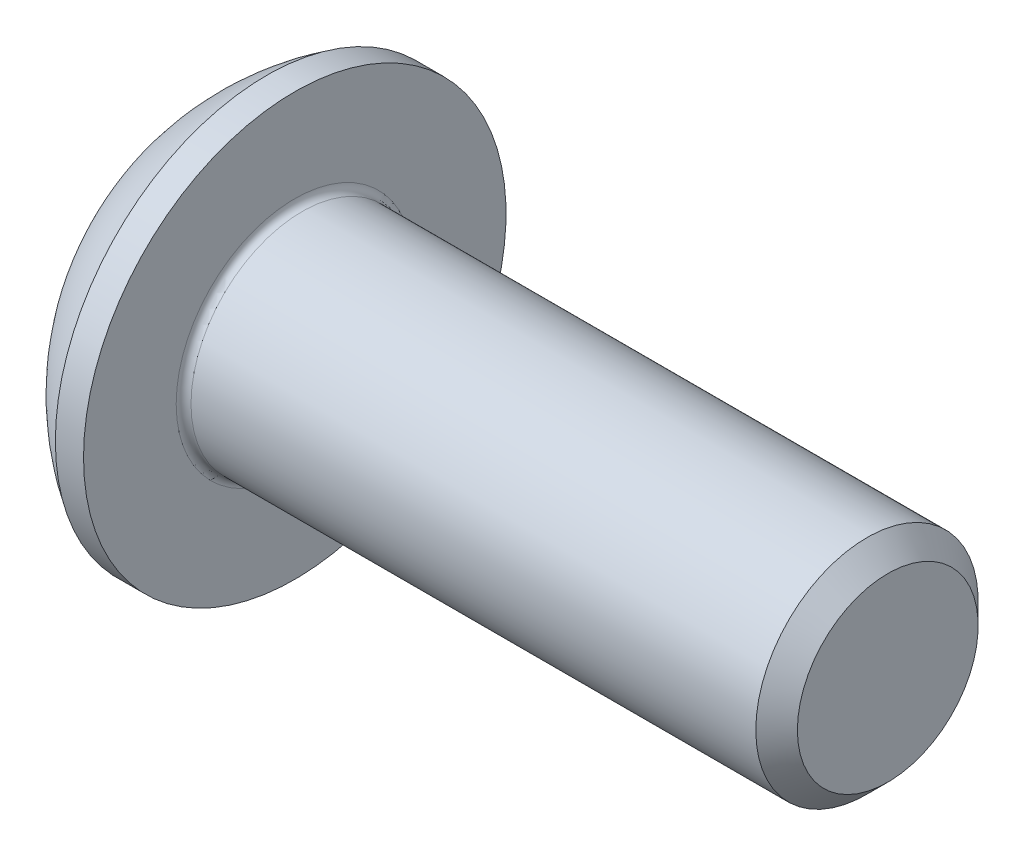
ISO-10303-21;
HEADER;
FILE_DESCRIPTION(('STEP AP214'),'2;1');
FILE_NAME('part.step','',(''),(''),'','','');
FILE_SCHEMA(('AUTOMOTIVE_DESIGN { 1 0 10303 214 1 1 1 1 }'));
ENDSEC;
DATA;
#1=APPLICATION_CONTEXT('core data for automotive mechanical design processes');
#2=APPLICATION_PROTOCOL_DEFINITION('international standard','automotive_design',2000,#1);
#3=PRODUCT_CONTEXT('',#1,'mechanical');
#4=PRODUCT('Part','Part','',(#3));
#5=PRODUCT_RELATED_PRODUCT_CATEGORY('part','',(#4));
#6=PRODUCT_DEFINITION_FORMATION('','',#4);
#7=PRODUCT_DEFINITION_CONTEXT('part definition',#1,'design');
#8=PRODUCT_DEFINITION('design','',#6,#7);
#9=PRODUCT_DEFINITION_SHAPE('','',#8);
#10=(LENGTH_UNIT() NAMED_UNIT(*) SI_UNIT(.MILLI.,.METRE.));
#11=(NAMED_UNIT(*) PLANE_ANGLE_UNIT() SI_UNIT($,.RADIAN.));
#12=(NAMED_UNIT(*) SI_UNIT($,.STERADIAN.) SOLID_ANGLE_UNIT());
#13=UNCERTAINTY_MEASURE_WITH_UNIT(LENGTH_MEASURE(1.E-05),#10,'distance_accuracy_value','');
#14=(GEOMETRIC_REPRESENTATION_CONTEXT(3) GLOBAL_UNCERTAINTY_ASSIGNED_CONTEXT((#13)) GLOBAL_UNIT_ASSIGNED_CONTEXT((#10,
#11,#12)) REPRESENTATION_CONTEXT('',''));
#15=CARTESIAN_POINT('',(0.,0.,0.));
#16=DIRECTION('',(0.,0.,1.));
#17=DIRECTION('',(1.,0.,0.));
#18=AXIS2_PLACEMENT_3D('',#15,#16,#17);
#19=CARTESIAN_POINT('',(0.,0.,0.));
#20=DIRECTION('',(-1.,0.,0.));
#21=DIRECTION('',(0.,0.,1.));
#22=AXIS2_PLACEMENT_3D('',#19,#20,#21);
#23=PLANE('',#22);
#24=CARTESIAN_POINT('',(0.,0.,0.));
#25=DIRECTION('',(-1.,0.,0.));
#26=DIRECTION('',(0.,0.,1.));
#27=AXIS2_PLACEMENT_3D('',#24,#25,#26);
#28=CIRCLE('',#27,1.425);
#29=CARTESIAN_POINT('',(0.,0.,1.425));
#30=VERTEX_POINT('',#29);
#31=EDGE_CURVE('E155',#30,#30,#28,.T.);
#32=ORIENTED_EDGE('',*,*,#31,.T.);
#33=EDGE_LOOP('',(#32));
#34=FACE_BOUND('',#33,.T.);
#35=DIRECTION('',(0.,-1.,0.));
#36=VECTOR('',#35,1.);
#37=CARTESIAN_POINT('',(0.,-0.577350269189626,1.));
#38=LINE('',#37,#36);
#39=CARTESIAN_POINT('',(0.,0.577350269189625,1.));
#40=VERTEX_POINT('',#39);
#41=CARTESIAN_POINT('',(0.,-0.577350269189626,1.));
#42=VERTEX_POINT('',#41);
#43=EDGE_CURVE('E50',#40,#42,#38,.T.);
#44=ORIENTED_EDGE('',*,*,#43,.T.);
#45=DIRECTION('',(0.,-0.5,-0.866025403784438));
#46=VECTOR('',#45,1.);
#47=CARTESIAN_POINT('',(0.,-1.15470053837925,0.));
#48=LINE('',#47,#46);
#49=CARTESIAN_POINT('',(0.,-1.15470053837925,0.));
#50=VERTEX_POINT('',#49);
#51=EDGE_CURVE('E275',#42,#50,#48,.T.);
#52=ORIENTED_EDGE('',*,*,#51,.T.);
#53=DIRECTION('',(0.,0.5,-0.866025403784438));
#54=VECTOR('',#53,1.);
#55=CARTESIAN_POINT('',(0.,-0.577350269189626,-1.));
#56=LINE('',#55,#54);
#57=CARTESIAN_POINT('',(0.,-0.577350269189626,-1.));
#58=VERTEX_POINT('',#57);
#59=EDGE_CURVE('E130',#50,#58,#56,.T.);
#60=ORIENTED_EDGE('',*,*,#59,.T.);
#61=DIRECTION('',(0.,1.,0.));
#62=VECTOR('',#61,1.);
#63=CARTESIAN_POINT('',(0.,0.577350269189625,-1.));
#64=LINE('',#63,#62);
#65=CARTESIAN_POINT('',(0.,0.577350269189625,-1.));
#66=VERTEX_POINT('',#65);
#67=EDGE_CURVE('E278',#58,#66,#64,.T.);
#68=ORIENTED_EDGE('',*,*,#67,.T.);
#69=DIRECTION('',(0.,0.5,0.866025403784439));
#70=VECTOR('',#69,1.);
#71=CARTESIAN_POINT('',(0.,1.15470053837925,0.));
#72=LINE('',#71,#70);
#73=CARTESIAN_POINT('',(0.,1.15470053837925,0.));
#74=VERTEX_POINT('',#73);
#75=EDGE_CURVE('E280',#66,#74,#72,.T.);
#76=ORIENTED_EDGE('',*,*,#75,.T.);
#77=DIRECTION('',(0.,-0.5,0.866025403784439));
#78=VECTOR('',#77,1.);
#79=CARTESIAN_POINT('',(0.,0.577350269189625,1.));
#80=LINE('',#79,#78);
#81=EDGE_CURVE('E282',#74,#40,#80,.T.);
#82=ORIENTED_EDGE('',*,*,#81,.T.);
#83=EDGE_LOOP('',(#44,#52,#60,#68,#76,#82));
#84=FACE_BOUND('',#83,.T.);
#85=ADVANCED_FACE('F35',(#34,#84),#23,.T.);
#86=CARTESIAN_POINT('',(3.03337598425197,0.,0.));
#87=DIRECTION('',(-1.,0.,0.));
#88=DIRECTION('',(0.,1.,0.));
#89=AXIS2_PLACEMENT_3D('',#86,#87,#88);
#90=SPHERICAL_SURFACE('',#89,3.35141684393879);
#91=CARTESIAN_POINT('',(1.27,0.,0.));
#92=DIRECTION('',(-1.,0.,0.));
#93=DIRECTION('',(0.,0.,1.));
#94=AXIS2_PLACEMENT_3D('',#91,#92,#93);
#95=CIRCLE('',#94,2.85);
#96=CARTESIAN_POINT('',(1.27,0.,2.85));
#97=VERTEX_POINT('',#96);
#98=EDGE_CURVE('E152',#97,#97,#95,.T.);
#99=ORIENTED_EDGE('',*,*,#98,.T.);
#100=EDGE_LOOP('',(#99));
#101=FACE_BOUND('',#100,.T.);
#102=ORIENTED_EDGE('',*,*,#31,.F.);
#103=EDGE_LOOP('',(#102));
#104=FACE_BOUND('',#103,.T.);
#105=ADVANCED_FACE('F176',(#101,#104),#90,.T.);
#106=CARTESIAN_POINT('',(0.,0.,0.));
#107=DIRECTION('',(-1.,0.,0.));
#108=DIRECTION('',(0.,0.,1.));
#109=AXIS2_PLACEMENT_3D('',#106,#107,#108);
#110=CYLINDRICAL_SURFACE('',#109,2.85);
#111=ORIENTED_EDGE('',*,*,#98,.F.);
#112=EDGE_LOOP('',(#111));
#113=FACE_BOUND('',#112,.T.);
#114=CARTESIAN_POINT('',(1.65,0.,0.));
#115=DIRECTION('',(-1.,0.,0.));
#116=DIRECTION('',(0.,0.,1.));
#117=AXIS2_PLACEMENT_3D('',#114,#115,#116);
#118=CIRCLE('',#117,2.85);
#119=CARTESIAN_POINT('',(1.65,0.,2.85));
#120=VERTEX_POINT('',#119);
#121=EDGE_CURVE('E149',#120,#120,#118,.T.);
#122=ORIENTED_EDGE('',*,*,#121,.T.);
#123=EDGE_LOOP('',(#122));
#124=FACE_BOUND('',#123,.T.);
#125=ADVANCED_FACE('F181',(#113,#124),#110,.T.);
#126=CARTESIAN_POINT('',(1.65,1.5,0.));
#127=DIRECTION('',(-1.,0.,0.));
#128=DIRECTION('',(0.,0.,1.));
#129=AXIS2_PLACEMENT_3D('',#126,#127,#128);
#130=PLANE('',#129);
#131=CARTESIAN_POINT('',(1.65,0.,0.));
#132=DIRECTION('',(-1.,0.,0.));
#133=DIRECTION('',(0.,0.,1.));
#134=AXIS2_PLACEMENT_3D('',#131,#132,#133);
#135=CIRCLE('',#134,1.6);
#136=CARTESIAN_POINT('',(1.65,0.,1.6));
#137=VERTEX_POINT('',#136);
#138=EDGE_CURVE('E43',#137,#137,#135,.T.);
#139=ORIENTED_EDGE('',*,*,#138,.T.);
#140=EDGE_LOOP('',(#139));
#141=FACE_BOUND('',#140,.T.);
#142=ORIENTED_EDGE('',*,*,#121,.F.);
#143=EDGE_LOOP('',(#142));
#144=FACE_BOUND('',#143,.T.);
#145=ADVANCED_FACE('F160',(#141,#144),#130,.F.);
#146=CARTESIAN_POINT('',(0.,0.,0.));
#147=DIRECTION('',(-1.,0.,0.));
#148=DIRECTION('',(0.,0.,1.));
#149=AXIS2_PLACEMENT_3D('',#146,#147,#148);
#150=CYLINDRICAL_SURFACE('',#149,1.5);
#151=CARTESIAN_POINT('',(1.75,0.,0.));
#152=DIRECTION('',(-1.,0.,0.));
#153=DIRECTION('',(0.,0.,1.));
#154=AXIS2_PLACEMENT_3D('',#151,#152,#153);
#155=CIRCLE('',#154,1.5);
#156=CARTESIAN_POINT('',(1.75,0.,1.5));
#157=VERTEX_POINT('',#156);
#158=EDGE_CURVE('E11',#157,#157,#155,.F.);
#159=ORIENTED_EDGE('',*,*,#158,.T.);
#160=EDGE_LOOP('',(#159));
#161=FACE_BOUND('',#160,.T.);
#162=CARTESIAN_POINT('',(9.3695,0.,0.));
#163=DIRECTION('',(-1.,0.,0.));
#164=DIRECTION('',(0.,0.,1.));
#165=AXIS2_PLACEMENT_3D('',#162,#163,#164);
#166=CIRCLE('',#165,1.5);
#167=CARTESIAN_POINT('',(9.3695,0.,1.5));
#168=VERTEX_POINT('',#167);
#169=EDGE_CURVE('E146',#168,#168,#166,.T.);
#170=ORIENTED_EDGE('',*,*,#169,.T.);
#171=EDGE_LOOP('',(#170));
#172=FACE_BOUND('',#171,.T.);
#173=ADVANCED_FACE('F190',(#161,#172),#150,.T.);
#174=CARTESIAN_POINT('',(9.65,0.,0.));
#175=DIRECTION('',(-1.,0.,0.));
#176=DIRECTION('',(0.,0.,1.));
#177=AXIS2_PLACEMENT_3D('',#174,#175,#176);
#178=CONICAL_SURFACE('',#177,1.2195,0.785398163397452);
#179=ORIENTED_EDGE('',*,*,#169,.F.);
#180=EDGE_LOOP('',(#179));
#181=FACE_BOUND('',#180,.T.);
#182=CARTESIAN_POINT('',(9.65,0.,0.));
#183=DIRECTION('',(-1.,0.,0.));
#184=DIRECTION('',(0.,0.,1.));
#185=AXIS2_PLACEMENT_3D('',#182,#183,#184);
#186=CIRCLE('',#185,1.2195);
#187=CARTESIAN_POINT('',(9.65,0.,1.2195));
#188=VERTEX_POINT('',#187);
#189=EDGE_CURVE('E142',#188,#188,#186,.T.);
#190=ORIENTED_EDGE('',*,*,#189,.T.);
#191=EDGE_LOOP('',(#190));
#192=FACE_BOUND('',#191,.T.);
#193=ADVANCED_FACE('F171',(#181,#192),#178,.T.);
#194=CARTESIAN_POINT('',(9.65,0.,0.));
#195=DIRECTION('',(-1.,0.,0.));
#196=DIRECTION('',(0.,0.,1.));
#197=AXIS2_PLACEMENT_3D('',#194,#195,#196);
#198=PLANE('',#197);
#199=ORIENTED_EDGE('',*,*,#189,.F.);
#200=EDGE_LOOP('',(#199));
#201=FACE_BOUND('',#200,.T.);
#202=ADVANCED_FACE('F164',(#201),#198,.F.);
#203=CARTESIAN_POINT('',(1.75,0.,0.));
#204=DIRECTION('',(-1.,0.,0.));
#205=DIRECTION('',(0.,0.,1.));
#206=AXIS2_PLACEMENT_3D('',#203,#204,#205);
#207=TOROIDAL_SURFACE('',#206,1.6,0.1);
#208=ORIENTED_EDGE('',*,*,#158,.F.);
#209=EDGE_LOOP('',(#208));
#210=FACE_BOUND('',#209,.T.);
#211=ORIENTED_EDGE('',*,*,#138,.F.);
#212=EDGE_LOOP('',(#211));
#213=FACE_BOUND('',#212,.T.);
#214=ADVANCED_FACE('F37',(#210,#213),#207,.F.);
#215=CARTESIAN_POINT('',(1.04,-1.15470053837925,0.));
#216=DIRECTION('',(0.,0.866025403784438,-0.5));
#217=DIRECTION('',(0.,0.5,0.866025403784438));
#218=AXIS2_PLACEMENT_3D('',#215,#216,#217);
#219=PLANE('',#218);
#220=DIRECTION('',(0.,-0.5,-0.866025403784438));
#221=VECTOR('',#220,1.);
#222=CARTESIAN_POINT('',(1.04,-1.15470053837925,0.));
#223=LINE('',#222,#221);
#224=CARTESIAN_POINT('',(1.04,-0.577350269189626,1.));
#225=VERTEX_POINT('',#224);
#226=CARTESIAN_POINT('',(1.04,-0.866025403784439,0.500000000000001));
#227=VERTEX_POINT('',#226);
#228=EDGE_CURVE('E116',#225,#227,#223,.T.);
#229=ORIENTED_EDGE('',*,*,#228,.T.);
#230=CARTESIAN_POINT('',(1.04,-1.15470053837925,0.));
#231=VERTEX_POINT('',#230);
#232=EDGE_CURVE('E111',#227,#231,#223,.T.);
#233=ORIENTED_EDGE('',*,*,#232,.T.);
#234=DIRECTION('',(-1.,0.,0.));
#235=VECTOR('',#234,1.);
#236=CARTESIAN_POINT('',(1.04,-1.15470053837925,0.));
#237=LINE('',#236,#235);
#238=EDGE_CURVE('E113',#231,#50,#237,.T.);
#239=ORIENTED_EDGE('',*,*,#238,.T.);
#240=ORIENTED_EDGE('',*,*,#51,.F.);
#241=DIRECTION('',(-1.,0.,0.));
#242=VECTOR('',#241,1.);
#243=CARTESIAN_POINT('',(1.04,-0.577350269189626,1.));
#244=LINE('',#243,#242);
#245=EDGE_CURVE('E271',#225,#42,#244,.T.);
#246=ORIENTED_EDGE('',*,*,#245,.F.);
#247=EDGE_LOOP('',(#229,#233,#239,#240,#246));
#248=FACE_BOUND('',#247,.T.);
#249=ADVANCED_FACE('F112',(#248),#219,.T.);
#250=CARTESIAN_POINT('',(1.04,-0.577350269189626,-1.));
#251=DIRECTION('',(0.,0.866025403784438,0.5));
#252=DIRECTION('',(0.,-0.5,0.866025403784438));
#253=AXIS2_PLACEMENT_3D('',#250,#251,#252);
#254=PLANE('',#253);
#255=DIRECTION('',(0.,0.5,-0.866025403784438));
#256=VECTOR('',#255,1.);
#257=CARTESIAN_POINT('',(1.04,-0.577350269189626,-1.));
#258=LINE('',#257,#256);
#259=CARTESIAN_POINT('',(1.04,-0.866025403784438,-0.5));
#260=VERTEX_POINT('',#259);
#261=EDGE_CURVE('E58',#231,#260,#258,.T.);
#262=ORIENTED_EDGE('',*,*,#261,.T.);
#263=CARTESIAN_POINT('',(1.04,-0.577350269189626,-1.));
#264=VERTEX_POINT('',#263);
#265=EDGE_CURVE('E125',#260,#264,#258,.T.);
#266=ORIENTED_EDGE('',*,*,#265,.T.);
#267=DIRECTION('',(-1.,0.,0.));
#268=VECTOR('',#267,1.);
#269=CARTESIAN_POINT('',(1.04,-0.577350269189626,-1.));
#270=LINE('',#269,#268);
#271=EDGE_CURVE('E132',#264,#58,#270,.T.);
#272=ORIENTED_EDGE('',*,*,#271,.T.);
#273=ORIENTED_EDGE('',*,*,#59,.F.);
#274=ORIENTED_EDGE('',*,*,#238,.F.);
#275=EDGE_LOOP('',(#262,#266,#272,#273,#274));
#276=FACE_BOUND('',#275,.T.);
#277=ADVANCED_FACE('F128',(#276),#254,.T.);
#278=CARTESIAN_POINT('',(1.04,0.577350269189625,-1.));
#279=DIRECTION('',(0.,0.,1.));
#280=DIRECTION('',(1.,0.,0.));
#281=AXIS2_PLACEMENT_3D('',#278,#279,#280);
#282=PLANE('',#281);
#283=DIRECTION('',(0.,1.,0.));
#284=VECTOR('',#283,1.);
#285=CARTESIAN_POINT('',(1.04,0.577350269189625,-1.));
#286=LINE('',#285,#284);
#287=CARTESIAN_POINT('',(1.04,0.,-1.));
#288=VERTEX_POINT('',#287);
#289=EDGE_CURVE('E252',#264,#288,#286,.T.);
#290=ORIENTED_EDGE('',*,*,#289,.T.);
#291=CARTESIAN_POINT('',(1.04,0.577350269189625,-1.));
#292=VERTEX_POINT('',#291);
#293=EDGE_CURVE('E124',#288,#292,#286,.T.);
#294=ORIENTED_EDGE('',*,*,#293,.T.);
#295=DIRECTION('',(-1.,0.,0.));
#296=VECTOR('',#295,1.);
#297=CARTESIAN_POINT('',(1.04,0.577350269189625,-1.));
#298=LINE('',#297,#296);
#299=EDGE_CURVE('E137',#292,#66,#298,.T.);
#300=ORIENTED_EDGE('',*,*,#299,.T.);
#301=ORIENTED_EDGE('',*,*,#67,.F.);
#302=ORIENTED_EDGE('',*,*,#271,.F.);
#303=EDGE_LOOP('',(#290,#294,#300,#301,#302));
#304=FACE_BOUND('',#303,.T.);
#305=ADVANCED_FACE('F204',(#304),#282,.T.);
#306=CARTESIAN_POINT('',(1.04,1.15470053837925,0.));
#307=DIRECTION('',(0.,-0.866025403784439,0.5));
#308=DIRECTION('',(0.,-0.5,-0.866025403784439));
#309=AXIS2_PLACEMENT_3D('',#306,#307,#308);
#310=PLANE('',#309);
#311=DIRECTION('',(0.,0.5,0.866025403784439));
#312=VECTOR('',#311,1.);
#313=CARTESIAN_POINT('',(1.04,1.15470053837925,0.));
#314=LINE('',#313,#312);
#315=CARTESIAN_POINT('',(1.04,0.866025403784438,-0.499999999999999));
#316=VERTEX_POINT('',#315);
#317=EDGE_CURVE('E241',#292,#316,#314,.T.);
#318=ORIENTED_EDGE('',*,*,#317,.T.);
#319=CARTESIAN_POINT('',(1.04,1.15470053837925,0.));
#320=VERTEX_POINT('',#319);
#321=EDGE_CURVE('E246',#316,#320,#314,.T.);
#322=ORIENTED_EDGE('',*,*,#321,.T.);
#323=DIRECTION('',(-1.,0.,0.));
#324=VECTOR('',#323,1.);
#325=CARTESIAN_POINT('',(1.04,1.15470053837925,0.));
#326=LINE('',#325,#324);
#327=EDGE_CURVE('E286',#320,#74,#326,.T.);
#328=ORIENTED_EDGE('',*,*,#327,.T.);
#329=ORIENTED_EDGE('',*,*,#75,.F.);
#330=ORIENTED_EDGE('',*,*,#299,.F.);
#331=EDGE_LOOP('',(#318,#322,#328,#329,#330));
#332=FACE_BOUND('',#331,.T.);
#333=ADVANCED_FACE('F207',(#332),#310,.T.);
#334=CARTESIAN_POINT('',(1.04,0.577350269189625,1.));
#335=DIRECTION('',(0.,-0.866025403784439,-0.5));
#336=DIRECTION('',(0.,0.5,-0.866025403784439));
#337=AXIS2_PLACEMENT_3D('',#334,#335,#336);
#338=PLANE('',#337);
#339=DIRECTION('',(0.,-0.5,0.866025403784439));
#340=VECTOR('',#339,1.);
#341=CARTESIAN_POINT('',(1.04,0.577350269189625,1.));
#342=LINE('',#341,#340);
#343=CARTESIAN_POINT('',(1.04,0.866025403784438,0.5));
#344=VERTEX_POINT('',#343);
#345=EDGE_CURVE('E249',#320,#344,#342,.T.);
#346=ORIENTED_EDGE('',*,*,#345,.T.);
#347=CARTESIAN_POINT('',(1.04,0.577350269189625,1.));
#348=VERTEX_POINT('',#347);
#349=EDGE_CURVE('E257',#344,#348,#342,.T.);
#350=ORIENTED_EDGE('',*,*,#349,.T.);
#351=DIRECTION('',(-1.,0.,0.));
#352=VECTOR('',#351,1.);
#353=CARTESIAN_POINT('',(1.04,0.577350269189625,1.));
#354=LINE('',#353,#352);
#355=EDGE_CURVE('E270',#348,#40,#354,.T.);
#356=ORIENTED_EDGE('',*,*,#355,.T.);
#357=ORIENTED_EDGE('',*,*,#81,.F.);
#358=ORIENTED_EDGE('',*,*,#327,.F.);
#359=EDGE_LOOP('',(#346,#350,#356,#357,#358));
#360=FACE_BOUND('',#359,.T.);
#361=ADVANCED_FACE('F211',(#360),#338,.T.);
#362=CARTESIAN_POINT('',(1.04,-0.577350269189626,1.));
#363=DIRECTION('',(0.,0.,-1.));
#364=DIRECTION('',(-1.,0.,0.));
#365=AXIS2_PLACEMENT_3D('',#362,#363,#364);
#366=PLANE('',#365);
#367=DIRECTION('',(0.,-1.,0.));
#368=VECTOR('',#367,1.);
#369=CARTESIAN_POINT('',(1.04,-0.577350269189626,1.));
#370=LINE('',#369,#368);
#371=CARTESIAN_POINT('',(1.04,0.,1.));
#372=VERTEX_POINT('',#371);
#373=EDGE_CURVE('E263',#348,#372,#370,.T.);
#374=ORIENTED_EDGE('',*,*,#373,.T.);
#375=EDGE_CURVE('E265',#372,#225,#370,.T.);
#376=ORIENTED_EDGE('',*,*,#375,.T.);
#377=ORIENTED_EDGE('',*,*,#245,.T.);
#378=ORIENTED_EDGE('',*,*,#43,.F.);
#379=ORIENTED_EDGE('',*,*,#355,.F.);
#380=EDGE_LOOP('',(#374,#376,#377,#378,#379));
#381=FACE_BOUND('',#380,.T.);
#382=ADVANCED_FACE('F215',(#381),#366,.T.);
#383=CARTESIAN_POINT('',(1.04,-1.15470053837925,0.));
#384=DIRECTION('',(1.,0.,0.));
#385=DIRECTION('',(0.,0.,-1.));
#386=AXIS2_PLACEMENT_3D('',#383,#384,#385);
#387=PLANE('',#386);
#388=CARTESIAN_POINT('',(1.04,0.,0.));
#389=DIRECTION('',(-1.,0.,0.));
#390=DIRECTION('',(0.,0.,1.));
#391=AXIS2_PLACEMENT_3D('',#388,#389,#390);
#392=CIRCLE('',#391,1.);
#393=EDGE_CURVE('E238',#316,#288,#392,.T.);
#394=ORIENTED_EDGE('',*,*,#393,.F.);
#395=ORIENTED_EDGE('',*,*,#317,.F.);
#396=ORIENTED_EDGE('',*,*,#293,.F.);
#397=EDGE_LOOP('',(#394,#395,#396));
#398=FACE_BOUND('',#397,.T.);
#399=ADVANCED_FACE('F219',(#398),#387,.F.);
#400=EDGE_CURVE('E143',#344,#316,#392,.T.);
#401=ORIENTED_EDGE('',*,*,#400,.F.);
#402=ORIENTED_EDGE('',*,*,#345,.F.);
#403=ORIENTED_EDGE('',*,*,#321,.F.);
#404=EDGE_LOOP('',(#401,#402,#403));
#405=FACE_BOUND('',#404,.T.);
#406=ADVANCED_FACE('F228',(#405),#387,.F.);
#407=EDGE_CURVE('E136',#372,#344,#392,.T.);
#408=ORIENTED_EDGE('',*,*,#407,.F.);
#409=ORIENTED_EDGE('',*,*,#373,.F.);
#410=ORIENTED_EDGE('',*,*,#349,.F.);
#411=EDGE_LOOP('',(#408,#409,#410));
#412=FACE_BOUND('',#411,.T.);
#413=ADVANCED_FACE('F233',(#412),#387,.F.);
#414=EDGE_CURVE('E131',#227,#372,#392,.T.);
#415=ORIENTED_EDGE('',*,*,#414,.F.);
#416=ORIENTED_EDGE('',*,*,#228,.F.);
#417=ORIENTED_EDGE('',*,*,#375,.F.);
#418=EDGE_LOOP('',(#415,#416,#417));
#419=FACE_BOUND('',#418,.T.);
#420=ADVANCED_FACE('F226',(#419),#387,.F.);
#421=EDGE_CURVE('E122',#260,#227,#392,.T.);
#422=ORIENTED_EDGE('',*,*,#421,.F.);
#423=ORIENTED_EDGE('',*,*,#261,.F.);
#424=ORIENTED_EDGE('',*,*,#232,.F.);
#425=EDGE_LOOP('',(#422,#423,#424));
#426=FACE_BOUND('',#425,.T.);
#427=ADVANCED_FACE('F121',(#426),#387,.F.);
#428=EDGE_CURVE('E244',#288,#260,#392,.T.);
#429=ORIENTED_EDGE('',*,*,#428,.F.);
#430=ORIENTED_EDGE('',*,*,#289,.F.);
#431=ORIENTED_EDGE('',*,*,#265,.F.);
#432=EDGE_LOOP('',(#429,#430,#431));
#433=FACE_BOUND('',#432,.T.);
#434=ADVANCED_FACE('F199',(#433),#387,.F.);
#435=CARTESIAN_POINT('',(1.61735026918963,0.,0.));
#436=DIRECTION('',(-1.,0.,0.));
#437=DIRECTION('',(0.,0.,1.));
#438=AXIS2_PLACEMENT_3D('',#435,#436,#437);
#439=CONICAL_SURFACE('',#438,0.,1.04719755119659);
#440=ORIENTED_EDGE('',*,*,#407,.T.);
#441=ORIENTED_EDGE('',*,*,#400,.T.);
#442=ORIENTED_EDGE('',*,*,#393,.T.);
#443=ORIENTED_EDGE('',*,*,#428,.T.);
#444=ORIENTED_EDGE('',*,*,#421,.T.);
#445=ORIENTED_EDGE('',*,*,#414,.T.);
#446=EDGE_LOOP('',(#440,#441,#442,#443,#444,#445));
#447=FACE_BOUND('',#446,.T.);
#448=CARTESIAN_POINT('',(1.61735026918963,0.,0.));
#449=VERTEX_POINT('',#448);
#450=VERTEX_LOOP('',#449);
#451=FACE_BOUND('',#450,.T.);
#452=ADVANCED_FACE('F197',(#447,#451),#439,.F.);
#453=CLOSED_SHELL('',(#85,#105,#125,#145,#173,#193,#202,#214,#249,#277,#305,#333,#361,#382,#399,
#406,#413,#420,#427,#434,#452));
#454=MANIFOLD_SOLID_BREP('B2',#453);
#455=ADVANCED_BREP_SHAPE_REPRESENTATION('',(#18,#454),#14);
#456=SHAPE_DEFINITION_REPRESENTATION(#9,#455);
ENDSEC;
END-ISO-10303-21;
